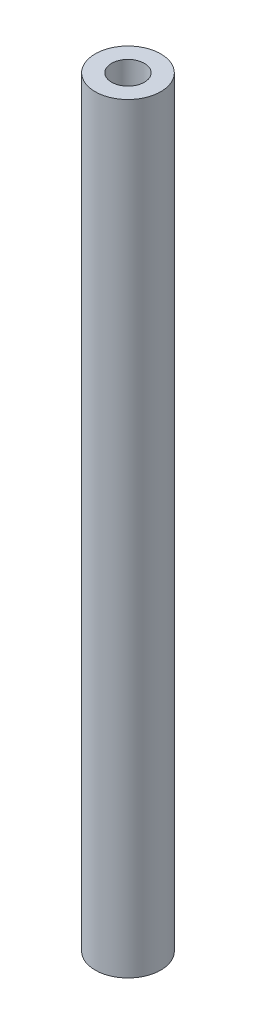
ISO-10303-21;
HEADER;
FILE_DESCRIPTION(('STEP AP214'),'2;1');
FILE_NAME('part.step','',(''),(''),'','','');
FILE_SCHEMA(('AUTOMOTIVE_DESIGN { 1 0 10303 214 1 1 1 1 }'));
ENDSEC;
DATA;
#1=APPLICATION_CONTEXT('core data for automotive mechanical design processes');
#2=APPLICATION_PROTOCOL_DEFINITION('international standard','automotive_design',2000,#1);
#3=PRODUCT_CONTEXT('',#1,'mechanical');
#4=PRODUCT('Part','Part','',(#3));
#5=PRODUCT_RELATED_PRODUCT_CATEGORY('part','',(#4));
#6=PRODUCT_DEFINITION_FORMATION('','',#4);
#7=PRODUCT_DEFINITION_CONTEXT('part definition',#1,'design');
#8=PRODUCT_DEFINITION('design','',#6,#7);
#9=PRODUCT_DEFINITION_SHAPE('','',#8);
#10=(LENGTH_UNIT() NAMED_UNIT(*) SI_UNIT(.MILLI.,.METRE.));
#11=(NAMED_UNIT(*) PLANE_ANGLE_UNIT() SI_UNIT($,.RADIAN.));
#12=(NAMED_UNIT(*) SI_UNIT($,.STERADIAN.) SOLID_ANGLE_UNIT());
#13=UNCERTAINTY_MEASURE_WITH_UNIT(LENGTH_MEASURE(1.E-05),#10,'distance_accuracy_value','');
#14=(GEOMETRIC_REPRESENTATION_CONTEXT(3) GLOBAL_UNCERTAINTY_ASSIGNED_CONTEXT((#13)) GLOBAL_UNIT_ASSIGNED_CONTEXT((#10,
#11,#12)) REPRESENTATION_CONTEXT('',''));
#15=CARTESIAN_POINT('',(0.,0.,0.));
#16=DIRECTION('',(0.,0.,1.));
#17=DIRECTION('',(1.,0.,0.));
#18=AXIS2_PLACEMENT_3D('',#15,#16,#17);
#19=CARTESIAN_POINT('',(0.,116.,0.));
#20=DIRECTION('',(0.,-1.,0.));
#21=DIRECTION('',(0.,0.,-1.));
#22=AXIS2_PLACEMENT_3D('',#19,#20,#21);
#23=CYLINDRICAL_SURFACE('',#22,5.);
#24=CARTESIAN_POINT('',(0.,116.,0.));
#25=DIRECTION('',(0.,1.,0.));
#26=DIRECTION('',(0.,0.,1.));
#27=AXIS2_PLACEMENT_3D('',#24,#25,#26);
#28=CIRCLE('',#27,5.);
#29=CARTESIAN_POINT('',(0.,116.,5.));
#30=VERTEX_POINT('',#29);
#31=EDGE_CURVE('E10',#30,#30,#28,.T.);
#32=ORIENTED_EDGE('',*,*,#31,.F.);
#33=EDGE_LOOP('',(#32));
#34=FACE_BOUND('',#33,.T.);
#35=CARTESIAN_POINT('',(0.,0.,0.));
#36=DIRECTION('',(0.,1.,0.));
#37=DIRECTION('',(0.,0.,1.));
#38=AXIS2_PLACEMENT_3D('',#35,#36,#37);
#39=CIRCLE('',#38,5.);
#40=CARTESIAN_POINT('',(0.,0.,5.));
#41=VERTEX_POINT('',#40);
#42=EDGE_CURVE('E37',#41,#41,#39,.T.);
#43=ORIENTED_EDGE('',*,*,#42,.T.);
#44=EDGE_LOOP('',(#43));
#45=FACE_BOUND('',#44,.T.);
#46=ADVANCED_FACE('F34',(#34,#45),#23,.T.);
#47=CARTESIAN_POINT('',(0.,116.,0.));
#48=DIRECTION('',(0.,1.,0.));
#49=DIRECTION('',(0.,0.,1.));
#50=AXIS2_PLACEMENT_3D('',#47,#48,#49);
#51=PLANE('',#50);
#52=CARTESIAN_POINT('',(0.,116.,0.));
#53=DIRECTION('',(0.,1.,0.));
#54=DIRECTION('',(0.,0.,1.));
#55=AXIS2_PLACEMENT_3D('',#52,#53,#54);
#56=CIRCLE('',#55,2.5);
#57=CARTESIAN_POINT('',(0.,116.,2.5));
#58=VERTEX_POINT('',#57);
#59=EDGE_CURVE('E46',#58,#58,#56,.T.);
#60=ORIENTED_EDGE('',*,*,#59,.F.);
#61=EDGE_LOOP('',(#60));
#62=FACE_BOUND('',#61,.T.);
#63=ORIENTED_EDGE('',*,*,#31,.T.);
#64=EDGE_LOOP('',(#63));
#65=FACE_BOUND('',#64,.T.);
#66=ADVANCED_FACE('F71',(#62,#65),#51,.T.);
#67=CARTESIAN_POINT('',(0.,0.,0.));
#68=DIRECTION('',(0.,1.,0.));
#69=DIRECTION('',(0.,0.,1.));
#70=AXIS2_PLACEMENT_3D('',#67,#68,#69);
#71=PLANE('',#70);
#72=CARTESIAN_POINT('',(0.,0.,0.));
#73=DIRECTION('',(0.,-1.,0.));
#74=DIRECTION('',(0.,0.,-1.));
#75=AXIS2_PLACEMENT_3D('',#72,#73,#74);
#76=CIRCLE('',#75,2.5);
#77=CARTESIAN_POINT('',(0.,0.,-2.5));
#78=VERTEX_POINT('',#77);
#79=EDGE_CURVE('E52',#78,#78,#76,.T.);
#80=ORIENTED_EDGE('',*,*,#79,.F.);
#81=EDGE_LOOP('',(#80));
#82=FACE_BOUND('',#81,.T.);
#83=ORIENTED_EDGE('',*,*,#42,.F.);
#84=EDGE_LOOP('',(#83));
#85=FACE_BOUND('',#84,.T.);
#86=ADVANCED_FACE('F67',(#82,#85),#71,.F.);
#87=CARTESIAN_POINT('',(0.,106.,0.));
#88=DIRECTION('',(0.,1.,0.));
#89=DIRECTION('',(0.,0.,1.));
#90=AXIS2_PLACEMENT_3D('',#87,#88,#89);
#91=CYLINDRICAL_SURFACE('',#90,2.5);
#92=CARTESIAN_POINT('',(0.,106.,0.));
#93=DIRECTION('',(0.,1.,0.));
#94=DIRECTION('',(0.,0.,1.));
#95=AXIS2_PLACEMENT_3D('',#92,#93,#94);
#96=CIRCLE('',#95,2.5);
#97=CARTESIAN_POINT('',(0.,106.,2.5));
#98=VERTEX_POINT('',#97);
#99=EDGE_CURVE('E44',#98,#98,#96,.T.);
#100=ORIENTED_EDGE('',*,*,#99,.F.);
#101=EDGE_LOOP('',(#100));
#102=FACE_BOUND('',#101,.T.);
#103=ORIENTED_EDGE('',*,*,#59,.T.);
#104=EDGE_LOOP('',(#103));
#105=FACE_BOUND('',#104,.T.);
#106=ADVANCED_FACE('F70',(#102,#105),#91,.F.);
#107=CARTESIAN_POINT('',(0.,106.,0.));
#108=DIRECTION('',(0.,1.,0.));
#109=DIRECTION('',(0.,0.,1.));
#110=AXIS2_PLACEMENT_3D('',#107,#108,#109);
#111=PLANE('',#110);
#112=ORIENTED_EDGE('',*,*,#99,.T.);
#113=EDGE_LOOP('',(#112));
#114=FACE_BOUND('',#113,.T.);
#115=ADVANCED_FACE('F63',(#114),#111,.T.);
#116=CARTESIAN_POINT('',(0.,10.,0.));
#117=DIRECTION('',(0.,-1.,0.));
#118=DIRECTION('',(0.,0.,-1.));
#119=AXIS2_PLACEMENT_3D('',#116,#117,#118);
#120=CYLINDRICAL_SURFACE('',#119,2.5);
#121=CARTESIAN_POINT('',(0.,10.,0.));
#122=DIRECTION('',(0.,-1.,0.));
#123=DIRECTION('',(0.,0.,-1.));
#124=AXIS2_PLACEMENT_3D('',#121,#122,#123);
#125=CIRCLE('',#124,2.5);
#126=CARTESIAN_POINT('',(0.,10.,-2.5));
#127=VERTEX_POINT('',#126);
#128=EDGE_CURVE('E49',#127,#127,#125,.T.);
#129=ORIENTED_EDGE('',*,*,#128,.F.);
#130=EDGE_LOOP('',(#129));
#131=FACE_BOUND('',#130,.T.);
#132=ORIENTED_EDGE('',*,*,#79,.T.);
#133=EDGE_LOOP('',(#132));
#134=FACE_BOUND('',#133,.T.);
#135=ADVANCED_FACE('F60',(#131,#134),#120,.F.);
#136=CARTESIAN_POINT('',(0.,10.,0.));
#137=DIRECTION('',(0.,-1.,0.));
#138=DIRECTION('',(0.,0.,-1.));
#139=AXIS2_PLACEMENT_3D('',#136,#137,#138);
#140=PLANE('',#139);
#141=ORIENTED_EDGE('',*,*,#128,.T.);
#142=EDGE_LOOP('',(#141));
#143=FACE_BOUND('',#142,.T.);
#144=ADVANCED_FACE('F58',(#143),#140,.T.);
#145=CLOSED_SHELL('',(#46,#66,#86,#106,#115,#135,#144));
#146=MANIFOLD_SOLID_BREP('B2',#145);
#147=ADVANCED_BREP_SHAPE_REPRESENTATION('',(#18,#146),#14);
#148=SHAPE_DEFINITION_REPRESENTATION(#9,#147);
ENDSEC;
END-ISO-10303-21;
